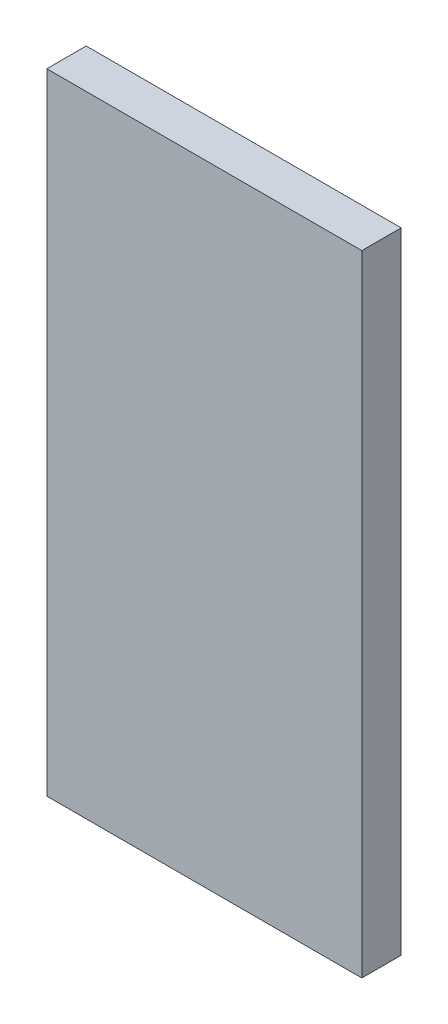
ISO-10303-21;
HEADER;
FILE_DESCRIPTION(('STEP AP214'),'2;1');
FILE_NAME('part.step','',(''),(''),'','','');
FILE_SCHEMA(('AUTOMOTIVE_DESIGN { 1 0 10303 214 1 1 1 1 }'));
ENDSEC;
DATA;
#1=APPLICATION_CONTEXT('core data for automotive mechanical design processes');
#2=APPLICATION_PROTOCOL_DEFINITION('international standard','automotive_design',2000,#1);
#3=PRODUCT_CONTEXT('',#1,'mechanical');
#4=PRODUCT('Part','Part','',(#3));
#5=PRODUCT_RELATED_PRODUCT_CATEGORY('part','',(#4));
#6=PRODUCT_DEFINITION_FORMATION('','',#4);
#7=PRODUCT_DEFINITION_CONTEXT('part definition',#1,'design');
#8=PRODUCT_DEFINITION('design','',#6,#7);
#9=PRODUCT_DEFINITION_SHAPE('','',#8);
#10=(LENGTH_UNIT() NAMED_UNIT(*) SI_UNIT(.MILLI.,.METRE.));
#11=(NAMED_UNIT(*) PLANE_ANGLE_UNIT() SI_UNIT($,.RADIAN.));
#12=(NAMED_UNIT(*) SI_UNIT($,.STERADIAN.) SOLID_ANGLE_UNIT());
#13=UNCERTAINTY_MEASURE_WITH_UNIT(LENGTH_MEASURE(1.E-05),#10,'distance_accuracy_value','');
#14=(GEOMETRIC_REPRESENTATION_CONTEXT(3) GLOBAL_UNCERTAINTY_ASSIGNED_CONTEXT((#13)) GLOBAL_UNIT_ASSIGNED_CONTEXT((#10,
#11,#12)) REPRESENTATION_CONTEXT('',''));
#15=CARTESIAN_POINT('',(0.,0.,0.));
#16=DIRECTION('',(0.,0.,1.));
#17=DIRECTION('',(1.,0.,0.));
#18=AXIS2_PLACEMENT_3D('',#15,#16,#17);
#19=CARTESIAN_POINT('',(-12.7,-25.4,1.5875));
#20=DIRECTION('',(1.,0.,0.));
#21=DIRECTION('',(0.,0.,-1.));
#22=AXIS2_PLACEMENT_3D('',#19,#20,#21);
#23=PLANE('',#22);
#24=DIRECTION('',(0.,-1.,0.));
#25=VECTOR('',#24,1.);
#26=CARTESIAN_POINT('',(-12.7,-25.4,-1.5875));
#27=LINE('',#26,#25);
#28=CARTESIAN_POINT('',(-12.7,25.4,-1.5875));
#29=VERTEX_POINT('',#28);
#30=CARTESIAN_POINT('',(-12.7,-25.4,-1.5875));
#31=VERTEX_POINT('',#30);
#32=EDGE_CURVE('E96',#29,#31,#27,.T.);
#33=ORIENTED_EDGE('',*,*,#32,.T.);
#34=DIRECTION('',(0.,0.,-1.));
#35=VECTOR('',#34,1.);
#36=CARTESIAN_POINT('',(-12.7,-25.4,1.5875));
#37=LINE('',#36,#35);
#38=CARTESIAN_POINT('',(-12.7,-25.4,1.5875));
#39=VERTEX_POINT('',#38);
#40=EDGE_CURVE('E11',#39,#31,#37,.T.);
#41=ORIENTED_EDGE('',*,*,#40,.F.);
#42=DIRECTION('',(0.,-1.,0.));
#43=VECTOR('',#42,1.);
#44=CARTESIAN_POINT('',(-12.7,-25.4,1.5875));
#45=LINE('',#44,#43);
#46=CARTESIAN_POINT('',(-12.7,25.4,1.5875));
#47=VERTEX_POINT('',#46);
#48=EDGE_CURVE('E84',#47,#39,#45,.T.);
#49=ORIENTED_EDGE('',*,*,#48,.F.);
#50=DIRECTION('',(0.,0.,-1.));
#51=VECTOR('',#50,1.);
#52=CARTESIAN_POINT('',(-12.7,25.4,1.5875));
#53=LINE('',#52,#51);
#54=EDGE_CURVE('E92',#47,#29,#53,.T.);
#55=ORIENTED_EDGE('',*,*,#54,.T.);
#56=EDGE_LOOP('',(#33,#41,#49,#55));
#57=FACE_BOUND('',#56,.T.);
#58=ADVANCED_FACE('F33',(#57),#23,.F.);
#59=CARTESIAN_POINT('',(12.7,-25.4,1.5875));
#60=DIRECTION('',(0.,1.,0.));
#61=DIRECTION('',(0.,0.,1.));
#62=AXIS2_PLACEMENT_3D('',#59,#60,#61);
#63=PLANE('',#62);
#64=DIRECTION('',(1.,0.,0.));
#65=VECTOR('',#64,1.);
#66=CARTESIAN_POINT('',(12.7,-25.4,-1.5875));
#67=LINE('',#66,#65);
#68=CARTESIAN_POINT('',(12.7,-25.4,-1.5875));
#69=VERTEX_POINT('',#68);
#70=EDGE_CURVE('E88',#31,#69,#67,.T.);
#71=ORIENTED_EDGE('',*,*,#70,.T.);
#72=DIRECTION('',(0.,0.,-1.));
#73=VECTOR('',#72,1.);
#74=CARTESIAN_POINT('',(12.7,-25.4,1.5875));
#75=LINE('',#74,#73);
#76=CARTESIAN_POINT('',(12.7,-25.4,1.5875));
#77=VERTEX_POINT('',#76);
#78=EDGE_CURVE('E41',#77,#69,#75,.T.);
#79=ORIENTED_EDGE('',*,*,#78,.F.);
#80=DIRECTION('',(1.,0.,0.));
#81=VECTOR('',#80,1.);
#82=CARTESIAN_POINT('',(12.7,-25.4,1.5875));
#83=LINE('',#82,#81);
#84=EDGE_CURVE('E79',#39,#77,#83,.T.);
#85=ORIENTED_EDGE('',*,*,#84,.F.);
#86=ORIENTED_EDGE('',*,*,#40,.T.);
#87=EDGE_LOOP('',(#71,#79,#85,#86));
#88=FACE_BOUND('',#87,.T.);
#89=ADVANCED_FACE('F87',(#88),#63,.F.);
#90=CARTESIAN_POINT('',(12.7,-25.4,1.5875));
#91=DIRECTION('',(-1.,0.,0.));
#92=DIRECTION('',(0.,0.,1.));
#93=AXIS2_PLACEMENT_3D('',#90,#91,#92);
#94=PLANE('',#93);
#95=DIRECTION('',(0.,1.,0.));
#96=VECTOR('',#95,1.);
#97=CARTESIAN_POINT('',(12.7,-25.4,-1.5875));
#98=LINE('',#97,#96);
#99=CARTESIAN_POINT('',(12.7,25.4,-1.5875));
#100=VERTEX_POINT('',#99);
#101=EDGE_CURVE('E66',#69,#100,#98,.T.);
#102=ORIENTED_EDGE('',*,*,#101,.T.);
#103=DIRECTION('',(0.,0.,-1.));
#104=VECTOR('',#103,1.);
#105=CARTESIAN_POINT('',(12.7,25.4,1.5875));
#106=LINE('',#105,#104);
#107=CARTESIAN_POINT('',(12.7,25.4,1.5875));
#108=VERTEX_POINT('',#107);
#109=EDGE_CURVE('E89',#108,#100,#106,.T.);
#110=ORIENTED_EDGE('',*,*,#109,.F.);
#111=DIRECTION('',(0.,1.,0.));
#112=VECTOR('',#111,1.);
#113=CARTESIAN_POINT('',(12.7,-25.4,1.5875));
#114=LINE('',#113,#112);
#115=EDGE_CURVE('E82',#77,#108,#114,.T.);
#116=ORIENTED_EDGE('',*,*,#115,.F.);
#117=ORIENTED_EDGE('',*,*,#78,.T.);
#118=EDGE_LOOP('',(#102,#110,#116,#117));
#119=FACE_BOUND('',#118,.T.);
#120=ADVANCED_FACE('F90',(#119),#94,.F.);
#121=CARTESIAN_POINT('',(12.7,25.4,1.5875));
#122=DIRECTION('',(0.,-1.,0.));
#123=DIRECTION('',(0.,0.,-1.));
#124=AXIS2_PLACEMENT_3D('',#121,#122,#123);
#125=PLANE('',#124);
#126=DIRECTION('',(-1.,0.,0.));
#127=VECTOR('',#126,1.);
#128=CARTESIAN_POINT('',(12.7,25.4,-1.5875));
#129=LINE('',#128,#127);
#130=EDGE_CURVE('E72',#100,#29,#129,.T.);
#131=ORIENTED_EDGE('',*,*,#130,.T.);
#132=ORIENTED_EDGE('',*,*,#54,.F.);
#133=DIRECTION('',(-1.,0.,0.));
#134=VECTOR('',#133,1.);
#135=CARTESIAN_POINT('',(12.7,25.4,1.5875));
#136=LINE('',#135,#134);
#137=EDGE_CURVE('E49',#108,#47,#136,.T.);
#138=ORIENTED_EDGE('',*,*,#137,.F.);
#139=ORIENTED_EDGE('',*,*,#109,.T.);
#140=EDGE_LOOP('',(#131,#132,#138,#139));
#141=FACE_BOUND('',#140,.T.);
#142=ADVANCED_FACE('F103',(#141),#125,.F.);
#143=CARTESIAN_POINT('',(0.,0.,1.5875));
#144=DIRECTION('',(0.,0.,1.));
#145=DIRECTION('',(1.,0.,0.));
#146=AXIS2_PLACEMENT_3D('',#143,#144,#145);
#147=PLANE('',#146);
#148=ORIENTED_EDGE('',*,*,#48,.T.);
#149=ORIENTED_EDGE('',*,*,#84,.T.);
#150=ORIENTED_EDGE('',*,*,#115,.T.);
#151=ORIENTED_EDGE('',*,*,#137,.T.);
#152=EDGE_LOOP('',(#148,#149,#150,#151));
#153=FACE_BOUND('',#152,.T.);
#154=ADVANCED_FACE('F80',(#153),#147,.T.);
#155=CARTESIAN_POINT('',(0.,0.,-1.5875));
#156=DIRECTION('',(0.,0.,1.));
#157=DIRECTION('',(1.,0.,0.));
#158=AXIS2_PLACEMENT_3D('',#155,#156,#157);
#159=PLANE('',#158);
#160=ORIENTED_EDGE('',*,*,#32,.F.);
#161=ORIENTED_EDGE('',*,*,#130,.F.);
#162=ORIENTED_EDGE('',*,*,#101,.F.);
#163=ORIENTED_EDGE('',*,*,#70,.F.);
#164=EDGE_LOOP('',(#160,#161,#162,#163));
#165=FACE_BOUND('',#164,.T.);
#166=ADVANCED_FACE('F106',(#165),#159,.F.);
#167=CLOSED_SHELL('',(#58,#89,#120,#142,#154,#166));
#168=MANIFOLD_SOLID_BREP('B2',#167);
#169=ADVANCED_BREP_SHAPE_REPRESENTATION('',(#18,#168),#14);
#170=SHAPE_DEFINITION_REPRESENTATION(#9,#169);
ENDSEC;
END-ISO-10303-21;
